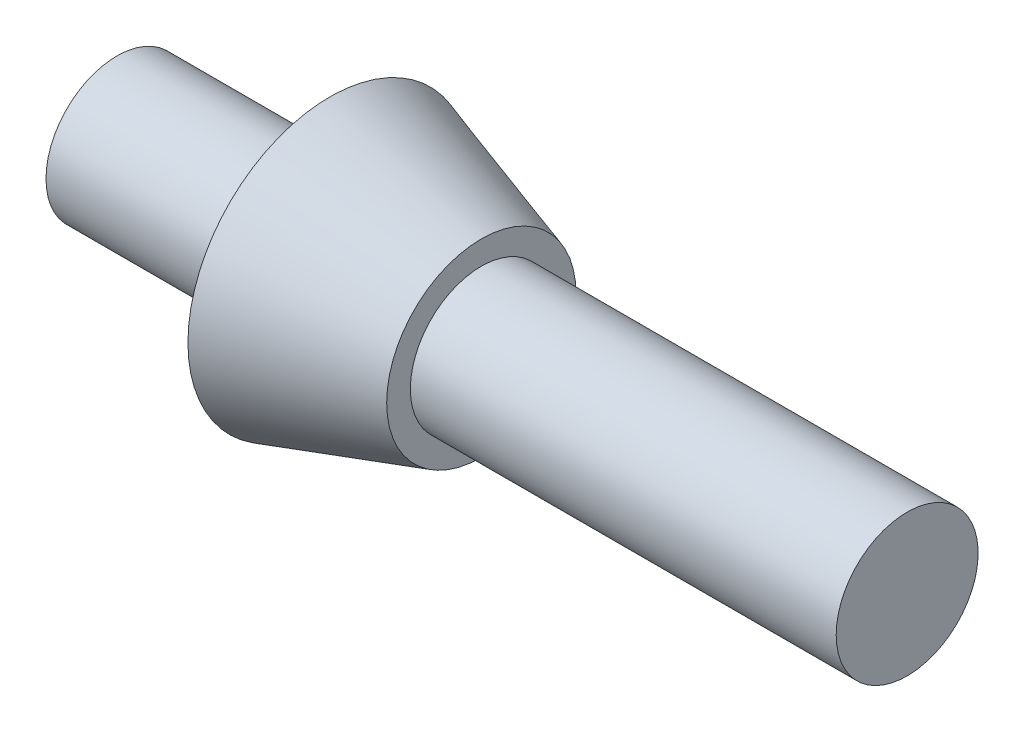
ISO-10303-21;
HEADER;
FILE_DESCRIPTION(('STEP AP214'),'2;1');
FILE_NAME('part.step','',(''),(''),'','','');
FILE_SCHEMA(('AUTOMOTIVE_DESIGN { 1 0 10303 214 1 1 1 1 }'));
ENDSEC;
DATA;
#1=APPLICATION_CONTEXT('core data for automotive mechanical design processes');
#2=APPLICATION_PROTOCOL_DEFINITION('international standard','automotive_design',2000,#1);
#3=PRODUCT_CONTEXT('',#1,'mechanical');
#4=PRODUCT('Part','Part','',(#3));
#5=PRODUCT_RELATED_PRODUCT_CATEGORY('part','',(#4));
#6=PRODUCT_DEFINITION_FORMATION('','',#4);
#7=PRODUCT_DEFINITION_CONTEXT('part definition',#1,'design');
#8=PRODUCT_DEFINITION('design','',#6,#7);
#9=PRODUCT_DEFINITION_SHAPE('','',#8);
#10=(LENGTH_UNIT() NAMED_UNIT(*) SI_UNIT(.MILLI.,.METRE.));
#11=(NAMED_UNIT(*) PLANE_ANGLE_UNIT() SI_UNIT($,.RADIAN.));
#12=(NAMED_UNIT(*) SI_UNIT($,.STERADIAN.) SOLID_ANGLE_UNIT());
#13=UNCERTAINTY_MEASURE_WITH_UNIT(LENGTH_MEASURE(1.E-05),#10,'distance_accuracy_value','');
#14=(GEOMETRIC_REPRESENTATION_CONTEXT(3) GLOBAL_UNCERTAINTY_ASSIGNED_CONTEXT((#13)) GLOBAL_UNIT_ASSIGNED_CONTEXT((#10,
#11,#12)) REPRESENTATION_CONTEXT('',''));
#15=CARTESIAN_POINT('',(0.,0.,0.));
#16=DIRECTION('',(0.,0.,1.));
#17=DIRECTION('',(1.,0.,0.));
#18=AXIS2_PLACEMENT_3D('',#15,#16,#17);
#19=CARTESIAN_POINT('',(-9.74631979576108,1.5,0.));
#20=DIRECTION('',(1.,0.,0.));
#21=DIRECTION('',(0.,0.,-1.));
#22=AXIS2_PLACEMENT_3D('',#19,#20,#21);
#23=PLANE('',#22);
#24=CARTESIAN_POINT('',(-9.74631979576109,0.,0.));
#25=DIRECTION('',(-1.,0.,0.));
#26=DIRECTION('',(0.,0.,1.));
#27=AXIS2_PLACEMENT_3D('',#24,#25,#26);
#28=CIRCLE('',#27,1.5);
#29=CARTESIAN_POINT('',(-9.74631979576109,0.,1.5));
#30=VERTEX_POINT('',#29);
#31=EDGE_CURVE('E10',#30,#30,#28,.T.);
#32=ORIENTED_EDGE('',*,*,#31,.T.);
#33=EDGE_LOOP('',(#32));
#34=FACE_BOUND('',#33,.T.);
#35=ADVANCED_FACE('F30',(#34),#23,.F.);
#36=CARTESIAN_POINT('',(-51.7301514382402,0.,0.));
#37=DIRECTION('',(-1.,0.,0.));
#38=DIRECTION('',(0.,0.,1.));
#39=AXIS2_PLACEMENT_3D('',#36,#37,#38);
#40=CYLINDRICAL_SURFACE('',#39,1.5);
#41=ORIENTED_EDGE('',*,*,#31,.F.);
#42=EDGE_LOOP('',(#41));
#43=FACE_BOUND('',#42,.T.);
#44=CARTESIAN_POINT('',(-5.24631979576108,0.,0.));
#45=DIRECTION('',(-1.,0.,0.));
#46=DIRECTION('',(0.,0.,1.));
#47=AXIS2_PLACEMENT_3D('',#44,#45,#46);
#48=CIRCLE('',#47,1.5);
#49=CARTESIAN_POINT('',(-5.24631979576108,0.,1.5));
#50=VERTEX_POINT('',#49);
#51=EDGE_CURVE('E36',#50,#50,#48,.T.);
#52=ORIENTED_EDGE('',*,*,#51,.T.);
#53=EDGE_LOOP('',(#52));
#54=FACE_BOUND('',#53,.T.);
#55=ADVANCED_FACE('F68',(#43,#54),#40,.T.);
#56=CARTESIAN_POINT('',(-5.24631979576108,1.5,0.));
#57=DIRECTION('',(1.,0.,0.));
#58=DIRECTION('',(0.,0.,-1.));
#59=AXIS2_PLACEMENT_3D('',#56,#57,#58);
#60=PLANE('',#59);
#61=ORIENTED_EDGE('',*,*,#51,.F.);
#62=EDGE_LOOP('',(#61));
#63=FACE_BOUND('',#62,.T.);
#64=CARTESIAN_POINT('',(-5.24631979576108,0.,0.));
#65=DIRECTION('',(-1.,0.,0.));
#66=DIRECTION('',(0.,0.,1.));
#67=AXIS2_PLACEMENT_3D('',#64,#65,#66);
#68=CIRCLE('',#67,3.);
#69=CARTESIAN_POINT('',(-5.24631979576108,0.,3.));
#70=VERTEX_POINT('',#69);
#71=EDGE_CURVE('E40',#70,#70,#68,.T.);
#72=ORIENTED_EDGE('',*,*,#71,.T.);
#73=EDGE_LOOP('',(#72));
#74=FACE_BOUND('',#73,.T.);
#75=ADVANCED_FACE('F72',(#63,#74),#60,.F.);
#76=CARTESIAN_POINT('',(-2.04631979576108,0.,0.));
#77=DIRECTION('',(-1.,0.,0.));
#78=DIRECTION('',(0.,0.,1.));
#79=AXIS2_PLACEMENT_3D('',#76,#77,#78);
#80=CONICAL_SURFACE('',#79,2.,0.302884868374971);
#81=ORIENTED_EDGE('',*,*,#71,.F.);
#82=EDGE_LOOP('',(#81));
#83=FACE_BOUND('',#82,.T.);
#84=CARTESIAN_POINT('',(-2.04631979576108,0.,0.));
#85=DIRECTION('',(-1.,0.,0.));
#86=DIRECTION('',(0.,0.,1.));
#87=AXIS2_PLACEMENT_3D('',#84,#85,#86);
#88=CIRCLE('',#87,2.);
#89=CARTESIAN_POINT('',(-2.04631979576108,0.,2.));
#90=VERTEX_POINT('',#89);
#91=EDGE_CURVE('E44',#90,#90,#88,.T.);
#92=ORIENTED_EDGE('',*,*,#91,.T.);
#93=EDGE_LOOP('',(#92));
#94=FACE_BOUND('',#93,.T.);
#95=ADVANCED_FACE('F77',(#83,#94),#80,.T.);
#96=CARTESIAN_POINT('',(-2.04631979576108,2.,0.));
#97=DIRECTION('',(-1.,0.,0.));
#98=DIRECTION('',(0.,0.,1.));
#99=AXIS2_PLACEMENT_3D('',#96,#97,#98);
#100=PLANE('',#99);
#101=ORIENTED_EDGE('',*,*,#91,.F.);
#102=EDGE_LOOP('',(#101));
#103=FACE_BOUND('',#102,.T.);
#104=CARTESIAN_POINT('',(-2.04631979576108,0.,0.));
#105=DIRECTION('',(-1.,0.,0.));
#106=DIRECTION('',(0.,0.,1.));
#107=AXIS2_PLACEMENT_3D('',#104,#105,#106);
#108=CIRCLE('',#107,1.5);
#109=CARTESIAN_POINT('',(-2.04631979576108,0.,1.5));
#110=VERTEX_POINT('',#109);
#111=EDGE_CURVE('E49',#110,#110,#108,.T.);
#112=ORIENTED_EDGE('',*,*,#111,.T.);
#113=EDGE_LOOP('',(#112));
#114=FACE_BOUND('',#113,.T.);
#115=ADVANCED_FACE('F64',(#103,#114),#100,.F.);
#116=CARTESIAN_POINT('',(-51.7301514382402,0.,0.));
#117=DIRECTION('',(-1.,0.,0.));
#118=DIRECTION('',(0.,0.,1.));
#119=AXIS2_PLACEMENT_3D('',#116,#117,#118);
#120=CYLINDRICAL_SURFACE('',#119,1.5);
#121=ORIENTED_EDGE('',*,*,#111,.F.);
#122=EDGE_LOOP('',(#121));
#123=FACE_BOUND('',#122,.T.);
#124=CARTESIAN_POINT('',(6.95368020423892,0.,0.));
#125=DIRECTION('',(-1.,0.,0.));
#126=DIRECTION('',(0.,0.,1.));
#127=AXIS2_PLACEMENT_3D('',#124,#125,#126);
#128=CIRCLE('',#127,1.5);
#129=CARTESIAN_POINT('',(6.95368020423892,0.,1.5));
#130=VERTEX_POINT('',#129);
#131=EDGE_CURVE('E52',#130,#130,#128,.T.);
#132=ORIENTED_EDGE('',*,*,#131,.T.);
#133=EDGE_LOOP('',(#132));
#134=FACE_BOUND('',#133,.T.);
#135=ADVANCED_FACE('F56',(#123,#134),#120,.T.);
#136=CARTESIAN_POINT('',(6.95368020423892,1.5,0.));
#137=DIRECTION('',(-1.,0.,0.));
#138=DIRECTION('',(0.,0.,1.));
#139=AXIS2_PLACEMENT_3D('',#136,#137,#138);
#140=PLANE('',#139);
#141=ORIENTED_EDGE('',*,*,#131,.F.);
#142=EDGE_LOOP('',(#141));
#143=FACE_BOUND('',#142,.T.);
#144=ADVANCED_FACE('F58',(#143),#140,.F.);
#145=CLOSED_SHELL('',(#35,#55,#75,#95,#115,#135,#144));
#146=MANIFOLD_SOLID_BREP('B2',#145);
#147=ADVANCED_BREP_SHAPE_REPRESENTATION('',(#18,#146),#14);
#148=SHAPE_DEFINITION_REPRESENTATION(#9,#147);
ENDSEC;
END-ISO-10303-21;
